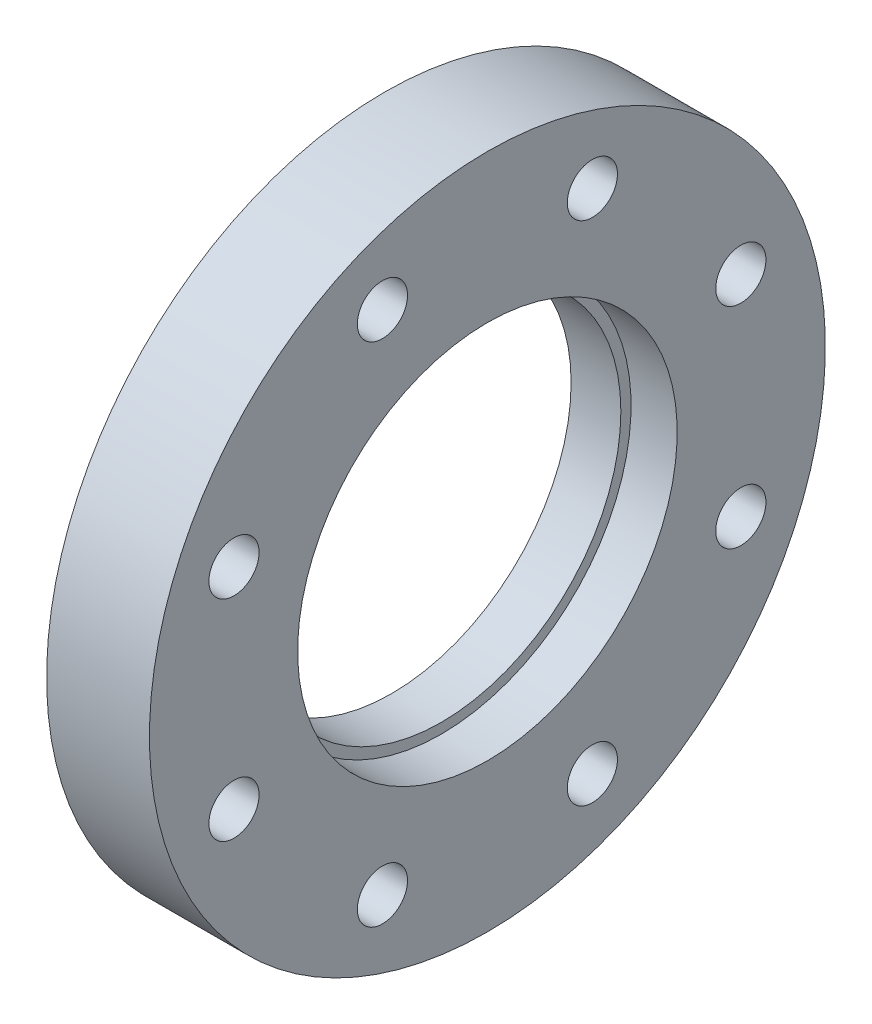
ISO-10303-21;
HEADER;
FILE_DESCRIPTION(('STEP AP214'),'2;1');
FILE_NAME('part.step','',(''),(''),'','','');
FILE_SCHEMA(('AUTOMOTIVE_DESIGN { 1 0 10303 214 1 1 1 1 }'));
ENDSEC;
DATA;
#1=APPLICATION_CONTEXT('core data for automotive mechanical design processes');
#2=APPLICATION_PROTOCOL_DEFINITION('international standard','automotive_design',2000,#1);
#3=PRODUCT_CONTEXT('',#1,'mechanical');
#4=PRODUCT('Part','Part','',(#3));
#5=PRODUCT_RELATED_PRODUCT_CATEGORY('part','',(#4));
#6=PRODUCT_DEFINITION_FORMATION('','',#4);
#7=PRODUCT_DEFINITION_CONTEXT('part definition',#1,'design');
#8=PRODUCT_DEFINITION('design','',#6,#7);
#9=PRODUCT_DEFINITION_SHAPE('','',#8);
#10=(LENGTH_UNIT() NAMED_UNIT(*) SI_UNIT(.MILLI.,.METRE.));
#11=(NAMED_UNIT(*) PLANE_ANGLE_UNIT() SI_UNIT($,.RADIAN.));
#12=(NAMED_UNIT(*) SI_UNIT($,.STERADIAN.) SOLID_ANGLE_UNIT());
#13=UNCERTAINTY_MEASURE_WITH_UNIT(LENGTH_MEASURE(1.E-05),#10,'distance_accuracy_value','');
#14=(GEOMETRIC_REPRESENTATION_CONTEXT(3) GLOBAL_UNCERTAINTY_ASSIGNED_CONTEXT((#13)) GLOBAL_UNIT_ASSIGNED_CONTEXT((#10,
#11,#12)) REPRESENTATION_CONTEXT('',''));
#15=CARTESIAN_POINT('',(0.,0.,0.));
#16=DIRECTION('',(0.,0.,1.));
#17=DIRECTION('',(1.,0.,0.));
#18=AXIS2_PLACEMENT_3D('',#15,#16,#17);
#19=CARTESIAN_POINT('',(0.893707741295802,0.,0.));
#20=DIRECTION('',(1.,0.,0.));
#21=DIRECTION('',(0.,1.,0.));
#22=AXIS2_PLACEMENT_3D('',#19,#20,#21);
#23=CYLINDRICAL_SURFACE('',#22,38.608);
#24=CARTESIAN_POINT('',(1.1700000000003,0.,0.));
#25=DIRECTION('',(1.,0.,0.));
#26=DIRECTION('',(0.,1.,0.));
#27=AXIS2_PLACEMENT_3D('',#24,#25,#26);
#28=CIRCLE('',#27,38.608);
#29=CARTESIAN_POINT('',(1.17000000000035,38.608,0.));
#30=VERTEX_POINT('',#29);
#31=EDGE_CURVE('E18',#30,#30,#28,.F.);
#32=ORIENTED_EDGE('',*,*,#31,.F.);
#33=EDGE_LOOP('',(#32));
#34=FACE_BOUND('',#33,.T.);
#35=CARTESIAN_POINT('',(0.617415480729711,0.,0.));
#36=DIRECTION('',(1.,0.,0.));
#37=DIRECTION('',(0.,1.,0.));
#38=AXIS2_PLACEMENT_3D('',#35,#36,#37);
#39=CIRCLE('',#38,38.6080000006776);
#40=CARTESIAN_POINT('',(0.617415480729764,38.6080000006776,0.));
#41=VERTEX_POINT('',#40);
#42=EDGE_CURVE('E101',#41,#41,#39,.T.);
#43=ORIENTED_EDGE('',*,*,#42,.F.);
#44=EDGE_LOOP('',(#43));
#45=FACE_BOUND('',#44,.T.);
#46=ADVANCED_FACE('F14',(#34,#45),#23,.F.);
#47=CARTESIAN_POINT('',(1.58812409924042,0.,0.));
#48=DIRECTION('',(1.,0.,0.));
#49=DIRECTION('',(0.,1.,0.));
#50=AXIS2_PLACEMENT_3D('',#47,#48,#49);
#51=CONICAL_SURFACE('',#50,41.2749999993224,1.22173047500015);
#52=ORIENTED_EDGE('',*,*,#42,.T.);
#53=EDGE_LOOP('',(#52));
#54=FACE_BOUND('',#53,.T.);
#55=CARTESIAN_POINT('',(1.58812409737882,0.,0.));
#56=DIRECTION('',(1.,0.,0.));
#57=DIRECTION('',(0.,1.,0.));
#58=AXIS2_PLACEMENT_3D('',#55,#56,#57);
#59=CIRCLE('',#58,41.275);
#60=CARTESIAN_POINT('',(1.58812409737888,41.275,0.));
#61=VERTEX_POINT('',#60);
#62=EDGE_CURVE('E93',#61,#61,#59,.F.);
#63=ORIENTED_EDGE('',*,*,#62,.T.);
#64=EDGE_LOOP('',(#63));
#65=FACE_BOUND('',#64,.T.);
#66=ADVANCED_FACE('F107',(#54,#65),#51,.T.);
#67=CARTESIAN_POINT('',(1.17000000000035,34.38525,0.));
#68=DIRECTION('',(-1.,0.,0.));
#69=DIRECTION('',(0.,0.,1.));
#70=AXIS2_PLACEMENT_3D('',#67,#68,#69);
#71=PLANE('',#70);
#72=CARTESIAN_POINT('',(1.17000000000031,0.,0.));
#73=DIRECTION('',(1.,0.,0.));
#74=DIRECTION('',(0.,1.,0.));
#75=AXIS2_PLACEMENT_3D('',#72,#73,#74);
#76=CIRCLE('',#75,30.1625);
#77=CARTESIAN_POINT('',(1.17000000000035,30.1625,0.));
#78=VERTEX_POINT('',#77);
#79=EDGE_CURVE('E91',#78,#78,#76,.T.);
#80=ORIENTED_EDGE('',*,*,#79,.T.);
#81=EDGE_LOOP('',(#80));
#82=FACE_BOUND('',#81,.T.);
#83=ORIENTED_EDGE('',*,*,#31,.T.);
#84=EDGE_LOOP('',(#83));
#85=FACE_BOUND('',#84,.T.);
#86=ADVANCED_FACE('F116',(#82,#85),#71,.T.);
#87=CARTESIAN_POINT('',(0.794062048689262,0.,0.));
#88=DIRECTION('',(1.,0.,0.));
#89=DIRECTION('',(0.,1.,0.));
#90=AXIS2_PLACEMENT_3D('',#87,#88,#89);
#91=CYLINDRICAL_SURFACE('',#90,41.275);
#92=ORIENTED_EDGE('',*,*,#62,.F.);
#93=EDGE_LOOP('',(#92));
#94=FACE_BOUND('',#93,.T.);
#95=CARTESIAN_POINT('',(-2.86879894839664E-13,0.,0.));
#96=DIRECTION('',(1.,0.,0.));
#97=DIRECTION('',(0.,1.,0.));
#98=AXIS2_PLACEMENT_3D('',#95,#96,#97);
#99=CIRCLE('',#98,41.275);
#100=CARTESIAN_POINT('',(-2.29051473539664E-13,41.275,0.));
#101=VERTEX_POINT('',#100);
#102=EDGE_CURVE('E89',#101,#101,#99,.T.);
#103=ORIENTED_EDGE('',*,*,#102,.F.);
#104=EDGE_LOOP('',(#103));
#105=FACE_BOUND('',#104,.T.);
#106=ADVANCED_FACE('F147',(#94,#105),#91,.F.);
#107=CARTESIAN_POINT('',(5.34750000000002,0.,0.));
#108=DIRECTION('',(1.,0.,0.));
#109=DIRECTION('',(0.,1.,0.));
#110=AXIS2_PLACEMENT_3D('',#107,#108,#109);
#111=CYLINDRICAL_SURFACE('',#110,30.1625);
#112=CARTESIAN_POINT('',(9.52499999999973,0.,0.));
#113=DIRECTION('',(1.,0.,0.));
#114=DIRECTION('',(0.,1.,0.));
#115=AXIS2_PLACEMENT_3D('',#112,#113,#114);
#116=CIRCLE('',#115,30.1625);
#117=CARTESIAN_POINT('',(9.52499999999977,30.1625,0.));
#118=VERTEX_POINT('',#117);
#119=EDGE_CURVE('E86',#118,#118,#116,.F.);
#120=ORIENTED_EDGE('',*,*,#119,.F.);
#121=EDGE_LOOP('',(#120));
#122=FACE_BOUND('',#121,.T.);
#123=ORIENTED_EDGE('',*,*,#79,.F.);
#124=EDGE_LOOP('',(#123));
#125=FACE_BOUND('',#124,.T.);
#126=ADVANCED_FACE('F143',(#122,#125),#111,.F.);
#127=CARTESIAN_POINT('',(-2.503946478E-13,49.0220000000002,0.));
#128=DIRECTION('',(-1.,0.,0.));
#129=DIRECTION('',(0.,0.,1.));
#130=AXIS2_PLACEMENT_3D('',#127,#128,#129);
#131=PLANE('',#130);
#132=ORIENTED_EDGE('',*,*,#102,.T.);
#133=EDGE_LOOP('',(#132));
#134=FACE_BOUND('',#133,.T.);
#135=CARTESIAN_POINT('',(-2.4980018054066E-13,17.632368756281,-42.568303788177));
#136=DIRECTION('',(-1.,0.,0.));
#137=DIRECTION('',(0.,-1.,0.));
#138=AXIS2_PLACEMENT_3D('',#135,#136,#137);
#139=CIRCLE('',#138,4.2164);
#140=CARTESIAN_POINT('',(-2.77555756156289E-13,13.4159687562811,-42.568303788177));
#141=VERTEX_POINT('',#140);
#142=EDGE_CURVE('E59',#141,#141,#139,.F.);
#143=ORIENTED_EDGE('',*,*,#142,.T.);
#144=EDGE_LOOP('',(#143));
#145=FACE_BOUND('',#144,.T.);
#146=CARTESIAN_POINT('',(-2.4980018054066E-13,-17.6323687562809,-42.5683037881771));
#147=DIRECTION('',(-1.,0.,0.));
#148=DIRECTION('',(0.,0.,1.));
#149=AXIS2_PLACEMENT_3D('',#146,#147,#148);
#150=CIRCLE('',#149,4.2164);
#151=CARTESIAN_POINT('',(-2.4980018054066E-13,-17.6323687562809,-38.3519037881771));
#152=VERTEX_POINT('',#151);
#153=EDGE_CURVE('E62',#152,#152,#150,.F.);
#154=ORIENTED_EDGE('',*,*,#153,.T.);
#155=EDGE_LOOP('',(#154));
#156=FACE_BOUND('',#155,.T.);
#157=CARTESIAN_POINT('',(-2.4980018054066E-13,42.568303788177,-17.6323687562809));
#158=DIRECTION('',(-1.,0.,0.));
#159=DIRECTION('',(0.,0.,1.));
#160=AXIS2_PLACEMENT_3D('',#157,#158,#159);
#161=CIRCLE('',#160,4.21639999999998);
#162=CARTESIAN_POINT('',(-2.4980018054066E-13,42.568303788177,-13.4159687562809));
#163=VERTEX_POINT('',#162);
#164=EDGE_CURVE('E65',#163,#163,#161,.F.);
#165=ORIENTED_EDGE('',*,*,#164,.T.);
#166=EDGE_LOOP('',(#165));
#167=FACE_BOUND('',#166,.T.);
#168=CARTESIAN_POINT('',(-2.4980018054066E-13,42.568303788177,17.632368756281));
#169=DIRECTION('',(-1.,0.,0.));
#170=DIRECTION('',(0.,0.,1.));
#171=AXIS2_PLACEMENT_3D('',#168,#169,#170);
#172=CIRCLE('',#171,4.2164);
#173=CARTESIAN_POINT('',(-2.4980018054066E-13,42.568303788177,21.848768756281));
#174=VERTEX_POINT('',#173);
#175=EDGE_CURVE('E68',#174,#174,#172,.F.);
#176=ORIENTED_EDGE('',*,*,#175,.T.);
#177=EDGE_LOOP('',(#176));
#178=FACE_BOUND('',#177,.T.);
#179=CARTESIAN_POINT('',(-2.4980018054066E-13,17.6323687562809,42.5683037881771));
#180=DIRECTION('',(-1.,0.,0.));
#181=DIRECTION('',(0.,0.,1.));
#182=AXIS2_PLACEMENT_3D('',#179,#180,#181);
#183=CIRCLE('',#182,4.2164);
#184=CARTESIAN_POINT('',(-2.4980018054066E-13,17.6323687562809,46.7847037881771));
#185=VERTEX_POINT('',#184);
#186=EDGE_CURVE('E71',#185,#185,#183,.F.);
#187=ORIENTED_EDGE('',*,*,#186,.T.);
#188=EDGE_LOOP('',(#187));
#189=FACE_BOUND('',#188,.T.);
#190=CARTESIAN_POINT('',(-2.4980018054066E-13,-17.632368756281,42.568303788177));
#191=DIRECTION('',(-1.,0.,0.));
#192=DIRECTION('',(0.,0.,1.));
#193=AXIS2_PLACEMENT_3D('',#190,#191,#192);
#194=CIRCLE('',#193,4.2164);
#195=CARTESIAN_POINT('',(-2.4980018054066E-13,-17.632368756281,46.784703788177));
#196=VERTEX_POINT('',#195);
#197=EDGE_CURVE('E74',#196,#196,#194,.F.);
#198=ORIENTED_EDGE('',*,*,#197,.T.);
#199=EDGE_LOOP('',(#198));
#200=FACE_BOUND('',#199,.T.);
#201=CARTESIAN_POINT('',(-2.4980018054066E-13,-42.5683037881771,17.6323687562809));
#202=DIRECTION('',(-1.,0.,0.));
#203=DIRECTION('',(0.,0.,1.));
#204=AXIS2_PLACEMENT_3D('',#201,#202,#203);
#205=CIRCLE('',#204,4.2164);
#206=CARTESIAN_POINT('',(-2.4980018054066E-13,-42.5683037881771,21.8487687562809));
#207=VERTEX_POINT('',#206);
#208=EDGE_CURVE('E77',#207,#207,#205,.F.);
#209=ORIENTED_EDGE('',*,*,#208,.T.);
#210=EDGE_LOOP('',(#209));
#211=FACE_BOUND('',#210,.T.);
#212=CARTESIAN_POINT('',(-2.4980018054066E-13,-42.5683037881771,-17.632368756281));
#213=DIRECTION('',(-1.,0.,0.));
#214=DIRECTION('',(0.,0.,1.));
#215=AXIS2_PLACEMENT_3D('',#212,#213,#214);
#216=CIRCLE('',#215,4.2164);
#217=CARTESIAN_POINT('',(-2.4980018054066E-13,-42.5683037881771,-13.415968756281));
#218=VERTEX_POINT('',#217);
#219=EDGE_CURVE('E80',#218,#218,#216,.F.);
#220=ORIENTED_EDGE('',*,*,#219,.T.);
#221=EDGE_LOOP('',(#220));
#222=FACE_BOUND('',#221,.T.);
#223=CARTESIAN_POINT('',(-3.52148865623292E-13,0.,0.));
#224=DIRECTION('',(1.,0.,0.));
#225=DIRECTION('',(0.,1.,0.));
#226=AXIS2_PLACEMENT_3D('',#223,#224,#225);
#227=CIRCLE('',#226,56.7690000000004);
#228=CARTESIAN_POINT('',(-2.72612544635291E-13,56.7690000000004,0.));
#229=VERTEX_POINT('',#228);
#230=EDGE_CURVE('E83',#229,#229,#227,.T.);
#231=ORIENTED_EDGE('',*,*,#230,.F.);
#232=EDGE_LOOP('',(#231));
#233=FACE_BOUND('',#232,.T.);
#234=ADVANCED_FACE('F139',(#134,#145,#156,#167,#178,#189,#200,#211,#222,#233),#131,.T.);
#235=CARTESIAN_POINT('',(9.52499999999977,31.01975,0.));
#236=DIRECTION('',(1.,0.,0.));
#237=DIRECTION('',(0.,0.,-1.));
#238=AXIS2_PLACEMENT_3D('',#235,#236,#237);
#239=PLANE('',#238);
#240=ORIENTED_EDGE('',*,*,#119,.T.);
#241=EDGE_LOOP('',(#240));
#242=FACE_BOUND('',#241,.T.);
#243=CARTESIAN_POINT('',(9.52499999999973,0.,0.));
#244=DIRECTION('',(1.,0.,0.));
#245=DIRECTION('',(0.,1.,0.));
#246=AXIS2_PLACEMENT_3D('',#243,#244,#245);
#247=CIRCLE('',#246,31.877);
#248=CARTESIAN_POINT('',(9.52499999999977,31.877,0.));
#249=VERTEX_POINT('',#248);
#250=EDGE_CURVE('E56',#249,#249,#247,.T.);
#251=ORIENTED_EDGE('',*,*,#250,.T.);
#252=EDGE_LOOP('',(#251));
#253=FACE_BOUND('',#252,.T.);
#254=ADVANCED_FACE('F135',(#242,#253),#239,.T.);
#255=CARTESIAN_POINT('',(8.6359999999999,0.,0.));
#256=DIRECTION('',(1.,0.,0.));
#257=DIRECTION('',(0.,1.,0.));
#258=AXIS2_PLACEMENT_3D('',#255,#256,#257);
#259=CYLINDRICAL_SURFACE('',#258,56.7690000000004);
#260=ORIENTED_EDGE('',*,*,#230,.T.);
#261=EDGE_LOOP('',(#260));
#262=FACE_BOUND('',#261,.T.);
#263=CARTESIAN_POINT('',(17.2720000000001,0.,0.));
#264=DIRECTION('',(1.,0.,0.));
#265=DIRECTION('',(0.,1.,0.));
#266=AXIS2_PLACEMENT_3D('',#263,#264,#265);
#267=CIRCLE('',#266,56.7690000000004);
#268=CARTESIAN_POINT('',(17.2720000000002,56.7690000000003,0.));
#269=VERTEX_POINT('',#268);
#270=EDGE_CURVE('E53',#269,#269,#267,.T.);
#271=ORIENTED_EDGE('',*,*,#270,.F.);
#272=EDGE_LOOP('',(#271));
#273=FACE_BOUND('',#272,.T.);
#274=ADVANCED_FACE('F131',(#262,#273),#259,.T.);
#275=CARTESIAN_POINT('',(17.2720000000002,-42.5683037881771,-17.632368756281));
#276=DIRECTION('',(-1.,0.,0.));
#277=DIRECTION('',(0.,0.,1.));
#278=AXIS2_PLACEMENT_3D('',#275,#276,#277);
#279=CYLINDRICAL_SURFACE('',#278,4.2164);
#280=CARTESIAN_POINT('',(17.2720000000002,-42.5683037881771,-17.632368756281));
#281=DIRECTION('',(-1.,0.,0.));
#282=DIRECTION('',(0.,0.,1.));
#283=AXIS2_PLACEMENT_3D('',#280,#281,#282);
#284=CIRCLE('',#283,4.2164);
#285=CARTESIAN_POINT('',(17.2720000000002,-42.5683037881771,-13.415968756281));
#286=VERTEX_POINT('',#285);
#287=EDGE_CURVE('E50',#286,#286,#284,.T.);
#288=ORIENTED_EDGE('',*,*,#287,.F.);
#289=EDGE_LOOP('',(#288));
#290=FACE_BOUND('',#289,.T.);
#291=ORIENTED_EDGE('',*,*,#219,.F.);
#292=EDGE_LOOP('',(#291));
#293=FACE_BOUND('',#292,.T.);
#294=ADVANCED_FACE('F134',(#290,#293),#279,.F.);
#295=CARTESIAN_POINT('',(17.2720000000002,-42.5683037881771,17.6323687562809));
#296=DIRECTION('',(-1.,0.,0.));
#297=DIRECTION('',(0.,0.,1.));
#298=AXIS2_PLACEMENT_3D('',#295,#296,#297);
#299=CYLINDRICAL_SURFACE('',#298,4.2164);
#300=CARTESIAN_POINT('',(17.2720000000002,-42.5683037881771,17.6323687562809));
#301=DIRECTION('',(-1.,0.,0.));
#302=DIRECTION('',(0.,0.,1.));
#303=AXIS2_PLACEMENT_3D('',#300,#301,#302);
#304=CIRCLE('',#303,4.2164);
#305=CARTESIAN_POINT('',(17.2720000000002,-42.5683037881771,21.8487687562809));
#306=VERTEX_POINT('',#305);
#307=EDGE_CURVE('E47',#306,#306,#304,.T.);
#308=ORIENTED_EDGE('',*,*,#307,.F.);
#309=EDGE_LOOP('',(#308));
#310=FACE_BOUND('',#309,.T.);
#311=ORIENTED_EDGE('',*,*,#208,.F.);
#312=EDGE_LOOP('',(#311));
#313=FACE_BOUND('',#312,.T.);
#314=ADVANCED_FACE('F187',(#310,#313),#299,.F.);
#315=CARTESIAN_POINT('',(17.2720000000002,-17.632368756281,42.568303788177));
#316=DIRECTION('',(-1.,0.,0.));
#317=DIRECTION('',(0.,0.,1.));
#318=AXIS2_PLACEMENT_3D('',#315,#316,#317);
#319=CYLINDRICAL_SURFACE('',#318,4.2164);
#320=CARTESIAN_POINT('',(17.2720000000002,-17.632368756281,42.568303788177));
#321=DIRECTION('',(-1.,0.,0.));
#322=DIRECTION('',(0.,0.,1.));
#323=AXIS2_PLACEMENT_3D('',#320,#321,#322);
#324=CIRCLE('',#323,4.2164);
#325=CARTESIAN_POINT('',(17.2720000000002,-17.632368756281,46.784703788177));
#326=VERTEX_POINT('',#325);
#327=EDGE_CURVE('E44',#326,#326,#324,.T.);
#328=ORIENTED_EDGE('',*,*,#327,.F.);
#329=EDGE_LOOP('',(#328));
#330=FACE_BOUND('',#329,.T.);
#331=ORIENTED_EDGE('',*,*,#197,.F.);
#332=EDGE_LOOP('',(#331));
#333=FACE_BOUND('',#332,.T.);
#334=ADVANCED_FACE('F194',(#330,#333),#319,.F.);
#335=CARTESIAN_POINT('',(17.2720000000002,17.6323687562809,42.5683037881771));
#336=DIRECTION('',(-1.,0.,0.));
#337=DIRECTION('',(0.,0.,1.));
#338=AXIS2_PLACEMENT_3D('',#335,#336,#337);
#339=CYLINDRICAL_SURFACE('',#338,4.2164);
#340=CARTESIAN_POINT('',(17.2720000000002,17.6323687562809,42.5683037881771));
#341=DIRECTION('',(-1.,0.,0.));
#342=DIRECTION('',(0.,0.,1.));
#343=AXIS2_PLACEMENT_3D('',#340,#341,#342);
#344=CIRCLE('',#343,4.2164);
#345=CARTESIAN_POINT('',(17.2720000000002,17.6323687562809,46.7847037881771));
#346=VERTEX_POINT('',#345);
#347=EDGE_CURVE('E41',#346,#346,#344,.T.);
#348=ORIENTED_EDGE('',*,*,#347,.F.);
#349=EDGE_LOOP('',(#348));
#350=FACE_BOUND('',#349,.T.);
#351=ORIENTED_EDGE('',*,*,#186,.F.);
#352=EDGE_LOOP('',(#351));
#353=FACE_BOUND('',#352,.T.);
#354=ADVANCED_FACE('F202',(#350,#353),#339,.F.);
#355=CARTESIAN_POINT('',(17.2720000000002,42.568303788177,17.632368756281));
#356=DIRECTION('',(-1.,0.,0.));
#357=DIRECTION('',(0.,0.,1.));
#358=AXIS2_PLACEMENT_3D('',#355,#356,#357);
#359=CYLINDRICAL_SURFACE('',#358,4.2164);
#360=CARTESIAN_POINT('',(17.2720000000002,42.568303788177,17.632368756281));
#361=DIRECTION('',(-1.,0.,0.));
#362=DIRECTION('',(0.,0.,1.));
#363=AXIS2_PLACEMENT_3D('',#360,#361,#362);
#364=CIRCLE('',#363,4.2164);
#365=CARTESIAN_POINT('',(17.2720000000002,42.568303788177,21.848768756281));
#366=VERTEX_POINT('',#365);
#367=EDGE_CURVE('E38',#366,#366,#364,.T.);
#368=ORIENTED_EDGE('',*,*,#367,.F.);
#369=EDGE_LOOP('',(#368));
#370=FACE_BOUND('',#369,.T.);
#371=ORIENTED_EDGE('',*,*,#175,.F.);
#372=EDGE_LOOP('',(#371));
#373=FACE_BOUND('',#372,.T.);
#374=ADVANCED_FACE('F210',(#370,#373),#359,.F.);
#375=CARTESIAN_POINT('',(17.2720000000002,42.568303788177,-17.6323687562809));
#376=DIRECTION('',(-1.,0.,0.));
#377=DIRECTION('',(0.,0.,1.));
#378=AXIS2_PLACEMENT_3D('',#375,#376,#377);
#379=CYLINDRICAL_SURFACE('',#378,4.21639999999998);
#380=CARTESIAN_POINT('',(17.2720000000002,42.568303788177,-17.6323687562809));
#381=DIRECTION('',(-1.,0.,0.));
#382=DIRECTION('',(0.,0.,1.));
#383=AXIS2_PLACEMENT_3D('',#380,#381,#382);
#384=CIRCLE('',#383,4.21639999999998);
#385=CARTESIAN_POINT('',(17.2720000000002,42.568303788177,-13.4159687562809));
#386=VERTEX_POINT('',#385);
#387=EDGE_CURVE('E35',#386,#386,#384,.T.);
#388=ORIENTED_EDGE('',*,*,#387,.F.);
#389=EDGE_LOOP('',(#388));
#390=FACE_BOUND('',#389,.T.);
#391=ORIENTED_EDGE('',*,*,#164,.F.);
#392=EDGE_LOOP('',(#391));
#393=FACE_BOUND('',#392,.T.);
#394=ADVANCED_FACE('F218',(#390,#393),#379,.F.);
#395=CARTESIAN_POINT('',(17.2720000000002,-17.6323687562809,-42.5683037881771));
#396=DIRECTION('',(-1.,0.,0.));
#397=DIRECTION('',(0.,0.,1.));
#398=AXIS2_PLACEMENT_3D('',#395,#396,#397);
#399=CYLINDRICAL_SURFACE('',#398,4.2164);
#400=CARTESIAN_POINT('',(17.2720000000002,-17.6323687562809,-42.5683037881771));
#401=DIRECTION('',(-1.,0.,0.));
#402=DIRECTION('',(0.,0.,1.));
#403=AXIS2_PLACEMENT_3D('',#400,#401,#402);
#404=CIRCLE('',#403,4.2164);
#405=CARTESIAN_POINT('',(17.2720000000002,-17.6323687562809,-38.3519037881771));
#406=VERTEX_POINT('',#405);
#407=EDGE_CURVE('E27',#406,#406,#404,.T.);
#408=ORIENTED_EDGE('',*,*,#407,.F.);
#409=EDGE_LOOP('',(#408));
#410=FACE_BOUND('',#409,.T.);
#411=ORIENTED_EDGE('',*,*,#153,.F.);
#412=EDGE_LOOP('',(#411));
#413=FACE_BOUND('',#412,.T.);
#414=ADVANCED_FACE('F226',(#410,#413),#399,.F.);
#415=CARTESIAN_POINT('',(17.2720000000002,17.6323687562809,-42.568303788177));
#416=DIRECTION('',(-1.,0.,0.));
#417=DIRECTION('',(0.,-1.,0.));
#418=AXIS2_PLACEMENT_3D('',#415,#416,#417);
#419=CYLINDRICAL_SURFACE('',#418,4.2164);
#420=CARTESIAN_POINT('',(17.2720000000002,17.6323687562809,-42.568303788177));
#421=DIRECTION('',(-1.,0.,0.));
#422=DIRECTION('',(0.,-1.,0.));
#423=AXIS2_PLACEMENT_3D('',#420,#421,#422);
#424=CIRCLE('',#423,4.2164);
#425=CARTESIAN_POINT('',(17.2720000000002,13.4159687562809,-42.568303788177));
#426=VERTEX_POINT('',#425);
#427=EDGE_CURVE('E22',#426,#426,#424,.T.);
#428=ORIENTED_EDGE('',*,*,#427,.F.);
#429=EDGE_LOOP('',(#428));
#430=FACE_BOUND('',#429,.T.);
#431=ORIENTED_EDGE('',*,*,#142,.F.);
#432=EDGE_LOOP('',(#431));
#433=FACE_BOUND('',#432,.T.);
#434=ADVANCED_FACE('F16',(#430,#433),#419,.F.);
#435=CARTESIAN_POINT('',(13.3985,0.,0.));
#436=DIRECTION('',(1.,0.,0.));
#437=DIRECTION('',(0.,1.,0.));
#438=AXIS2_PLACEMENT_3D('',#435,#436,#437);
#439=CYLINDRICAL_SURFACE('',#438,31.877);
#440=CARTESIAN_POINT('',(17.2720000000002,0.,0.));
#441=DIRECTION('',(1.,0.,0.));
#442=DIRECTION('',(0.,1.,0.));
#443=AXIS2_PLACEMENT_3D('',#440,#441,#442);
#444=CIRCLE('',#443,31.877);
#445=CARTESIAN_POINT('',(17.2720000000003,31.877,0.));
#446=VERTEX_POINT('',#445);
#447=EDGE_CURVE('E10',#446,#446,#444,.F.);
#448=ORIENTED_EDGE('',*,*,#447,.F.);
#449=EDGE_LOOP('',(#448));
#450=FACE_BOUND('',#449,.T.);
#451=ORIENTED_EDGE('',*,*,#250,.F.);
#452=EDGE_LOOP('',(#451));
#453=FACE_BOUND('',#452,.T.);
#454=ADVANCED_FACE('F122',(#450,#453),#439,.F.);
#455=CARTESIAN_POINT('',(17.2720000000002,44.3230000000002,0.));
#456=DIRECTION('',(1.,0.,0.));
#457=DIRECTION('',(0.,0.,-1.));
#458=AXIS2_PLACEMENT_3D('',#455,#456,#457);
#459=PLANE('',#458);
#460=ORIENTED_EDGE('',*,*,#447,.T.);
#461=EDGE_LOOP('',(#460));
#462=FACE_BOUND('',#461,.T.);
#463=ORIENTED_EDGE('',*,*,#427,.T.);
#464=EDGE_LOOP('',(#463));
#465=FACE_BOUND('',#464,.T.);
#466=ORIENTED_EDGE('',*,*,#407,.T.);
#467=EDGE_LOOP('',(#466));
#468=FACE_BOUND('',#467,.T.);
#469=ORIENTED_EDGE('',*,*,#387,.T.);
#470=EDGE_LOOP('',(#469));
#471=FACE_BOUND('',#470,.T.);
#472=ORIENTED_EDGE('',*,*,#367,.T.);
#473=EDGE_LOOP('',(#472));
#474=FACE_BOUND('',#473,.T.);
#475=ORIENTED_EDGE('',*,*,#347,.T.);
#476=EDGE_LOOP('',(#475));
#477=FACE_BOUND('',#476,.T.);
#478=ORIENTED_EDGE('',*,*,#327,.T.);
#479=EDGE_LOOP('',(#478));
#480=FACE_BOUND('',#479,.T.);
#481=ORIENTED_EDGE('',*,*,#307,.T.);
#482=EDGE_LOOP('',(#481));
#483=FACE_BOUND('',#482,.T.);
#484=ORIENTED_EDGE('',*,*,#287,.T.);
#485=EDGE_LOOP('',(#484));
#486=FACE_BOUND('',#485,.T.);
#487=ORIENTED_EDGE('',*,*,#270,.T.);
#488=EDGE_LOOP('',(#487));
#489=FACE_BOUND('',#488,.T.);
#490=ADVANCED_FACE('F120',(#462,#465,#468,#471,#474,#477,#480,#483,#486,#489),#459,.T.);
#491=CLOSED_SHELL('',(#46,#66,#86,#106,#126,#234,#254,#274,#294,#314,#334,#354,#374,#394,#414,
#434,#454,#490));
#492=MANIFOLD_SOLID_BREP('B1',#491);
#493=ADVANCED_BREP_SHAPE_REPRESENTATION('',(#18,#492),#14);
#494=SHAPE_DEFINITION_REPRESENTATION(#9,#493);
ENDSEC;
END-ISO-10303-21;
